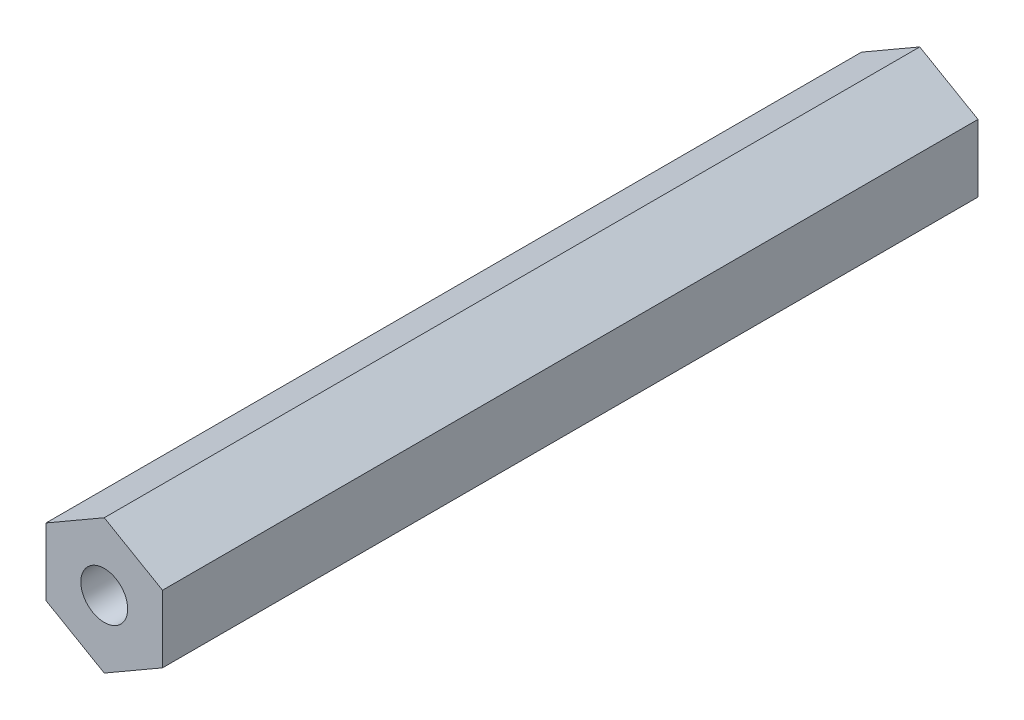
ISO-10303-21;
HEADER;
FILE_DESCRIPTION(('STEP AP214'),'2;1');
FILE_NAME('part.step','',(''),(''),'','','');
FILE_SCHEMA(('AUTOMOTIVE_DESIGN { 1 0 10303 214 1 1 1 1 }'));
ENDSEC;
DATA;
#1=APPLICATION_CONTEXT('core data for automotive mechanical design processes');
#2=APPLICATION_PROTOCOL_DEFINITION('international standard','automotive_design',2000,#1);
#3=PRODUCT_CONTEXT('',#1,'mechanical');
#4=PRODUCT('Part','Part','',(#3));
#5=PRODUCT_RELATED_PRODUCT_CATEGORY('part','',(#4));
#6=PRODUCT_DEFINITION_FORMATION('','',#4);
#7=PRODUCT_DEFINITION_CONTEXT('part definition',#1,'design');
#8=PRODUCT_DEFINITION('design','',#6,#7);
#9=PRODUCT_DEFINITION_SHAPE('','',#8);
#10=(LENGTH_UNIT() NAMED_UNIT(*) SI_UNIT(.MILLI.,.METRE.));
#11=(NAMED_UNIT(*) PLANE_ANGLE_UNIT() SI_UNIT($,.RADIAN.));
#12=(NAMED_UNIT(*) SI_UNIT($,.STERADIAN.) SOLID_ANGLE_UNIT());
#13=UNCERTAINTY_MEASURE_WITH_UNIT(LENGTH_MEASURE(1.E-05),#10,'distance_accuracy_value','');
#14=(GEOMETRIC_REPRESENTATION_CONTEXT(3) GLOBAL_UNCERTAINTY_ASSIGNED_CONTEXT((#13)) GLOBAL_UNIT_ASSIGNED_CONTEXT((#10,
#11,#12)) REPRESENTATION_CONTEXT('',''));
#15=CARTESIAN_POINT('',(0.,0.,0.));
#16=DIRECTION('',(0.,0.,1.));
#17=DIRECTION('',(1.,0.,0.));
#18=AXIS2_PLACEMENT_3D('',#15,#16,#17);
#19=CARTESIAN_POINT('',(6.35,-3.66617420935412,88.9));
#20=DIRECTION('',(-1.,0.,0.));
#21=DIRECTION('',(0.,-1.,0.));
#22=AXIS2_PLACEMENT_3D('',#19,#20,#21);
#23=PLANE('',#22);
#24=DIRECTION('',(0.,1.,0.));
#25=VECTOR('',#24,1.);
#26=CARTESIAN_POINT('',(6.35,-3.66617420935412,0.));
#27=LINE('',#26,#25);
#28=CARTESIAN_POINT('',(6.35,-3.66617420935412,0.));
#29=VERTEX_POINT('',#28);
#30=CARTESIAN_POINT('',(6.35,3.66617420935413,0.));
#31=VERTEX_POINT('',#30);
#32=EDGE_CURVE('E139',#29,#31,#27,.T.);
#33=ORIENTED_EDGE('',*,*,#32,.T.);
#34=DIRECTION('',(0.,0.,-1.));
#35=VECTOR('',#34,1.);
#36=CARTESIAN_POINT('',(6.35,3.66617420935413,88.9));
#37=LINE('',#36,#35);
#38=CARTESIAN_POINT('',(6.35,3.66617420935413,88.9));
#39=VERTEX_POINT('',#38);
#40=EDGE_CURVE('E11',#39,#31,#37,.T.);
#41=ORIENTED_EDGE('',*,*,#40,.F.);
#42=DIRECTION('',(0.,1.,0.));
#43=VECTOR('',#42,1.);
#44=CARTESIAN_POINT('',(6.35,-3.66617420935412,88.9));
#45=LINE('',#44,#43);
#46=CARTESIAN_POINT('',(6.35,-3.66617420935412,88.9));
#47=VERTEX_POINT('',#46);
#48=EDGE_CURVE('E156',#47,#39,#45,.T.);
#49=ORIENTED_EDGE('',*,*,#48,.F.);
#50=DIRECTION('',(0.,0.,-1.));
#51=VECTOR('',#50,1.);
#52=CARTESIAN_POINT('',(6.35,-3.66617420935412,88.9));
#53=LINE('',#52,#51);
#54=EDGE_CURVE('E135',#47,#29,#53,.T.);
#55=ORIENTED_EDGE('',*,*,#54,.T.);
#56=EDGE_LOOP('',(#33,#41,#49,#55));
#57=FACE_BOUND('',#56,.T.);
#58=ADVANCED_FACE('F46',(#57),#23,.F.);
#59=CARTESIAN_POINT('',(6.35,3.66617420935413,88.9));
#60=DIRECTION('',(-0.5,-0.866025403784439,0.));
#61=DIRECTION('',(0.866025403784439,-0.5,0.));
#62=AXIS2_PLACEMENT_3D('',#59,#60,#61);
#63=PLANE('',#62);
#64=DIRECTION('',(-0.866025403784439,0.5,0.));
#65=VECTOR('',#64,1.);
#66=CARTESIAN_POINT('',(6.35,3.66617420935413,0.));
#67=LINE('',#66,#65);
#68=CARTESIAN_POINT('',(0.,7.33234841870824,0.));
#69=VERTEX_POINT('',#68);
#70=EDGE_CURVE('E143',#31,#69,#67,.T.);
#71=ORIENTED_EDGE('',*,*,#70,.T.);
#72=DIRECTION('',(0.,0.,-1.));
#73=VECTOR('',#72,1.);
#74=CARTESIAN_POINT('',(0.,7.33234841870824,88.9));
#75=LINE('',#74,#73);
#76=CARTESIAN_POINT('',(0.,7.33234841870824,88.9));
#77=VERTEX_POINT('',#76);
#78=EDGE_CURVE('E55',#77,#69,#75,.T.);
#79=ORIENTED_EDGE('',*,*,#78,.F.);
#80=DIRECTION('',(-0.866025403784439,0.5,0.));
#81=VECTOR('',#80,1.);
#82=CARTESIAN_POINT('',(6.35,3.66617420935413,88.9));
#83=LINE('',#82,#81);
#84=EDGE_CURVE('E101',#39,#77,#83,.T.);
#85=ORIENTED_EDGE('',*,*,#84,.F.);
#86=ORIENTED_EDGE('',*,*,#40,.T.);
#87=EDGE_LOOP('',(#71,#79,#85,#86));
#88=FACE_BOUND('',#87,.T.);
#89=ADVANCED_FACE('F186',(#88),#63,.F.);
#90=CARTESIAN_POINT('',(0.,7.33234841870824,88.9));
#91=DIRECTION('',(0.5,-0.866025403784439,0.));
#92=DIRECTION('',(0.866025403784439,0.5,0.));
#93=AXIS2_PLACEMENT_3D('',#90,#91,#92);
#94=PLANE('',#93);
#95=DIRECTION('',(-0.866025403784439,-0.5,0.));
#96=VECTOR('',#95,1.);
#97=CARTESIAN_POINT('',(0.,7.33234841870824,0.));
#98=LINE('',#97,#96);
#99=CARTESIAN_POINT('',(-6.35,3.66617420935412,0.));
#100=VERTEX_POINT('',#99);
#101=EDGE_CURVE('E147',#69,#100,#98,.T.);
#102=ORIENTED_EDGE('',*,*,#101,.T.);
#103=DIRECTION('',(0.,0.,-1.));
#104=VECTOR('',#103,1.);
#105=CARTESIAN_POINT('',(-6.35,3.66617420935412,88.9));
#106=LINE('',#105,#104);
#107=CARTESIAN_POINT('',(-6.35,3.66617420935412,88.9));
#108=VERTEX_POINT('',#107);
#109=EDGE_CURVE('E127',#108,#100,#106,.T.);
#110=ORIENTED_EDGE('',*,*,#109,.F.);
#111=DIRECTION('',(-0.866025403784439,-0.5,0.));
#112=VECTOR('',#111,1.);
#113=CARTESIAN_POINT('',(0.,7.33234841870824,88.9));
#114=LINE('',#113,#112);
#115=EDGE_CURVE('E116',#77,#108,#114,.T.);
#116=ORIENTED_EDGE('',*,*,#115,.F.);
#117=ORIENTED_EDGE('',*,*,#78,.T.);
#118=EDGE_LOOP('',(#102,#110,#116,#117));
#119=FACE_BOUND('',#118,.T.);
#120=ADVANCED_FACE('F167',(#119),#94,.F.);
#121=CARTESIAN_POINT('',(-6.35,3.66617420935412,88.9));
#122=DIRECTION('',(1.,0.,0.));
#123=DIRECTION('',(0.,1.,0.));
#124=AXIS2_PLACEMENT_3D('',#121,#122,#123);
#125=PLANE('',#124);
#126=DIRECTION('',(0.,-1.,0.));
#127=VECTOR('',#126,1.);
#128=CARTESIAN_POINT('',(-6.35,3.66617420935412,0.));
#129=LINE('',#128,#127);
#130=CARTESIAN_POINT('',(-6.35,-3.66617420935412,0.));
#131=VERTEX_POINT('',#130);
#132=EDGE_CURVE('E125',#100,#131,#129,.T.);
#133=ORIENTED_EDGE('',*,*,#132,.T.);
#134=DIRECTION('',(0.,0.,-1.));
#135=VECTOR('',#134,1.);
#136=CARTESIAN_POINT('',(-6.35,-3.66617420935412,88.9));
#137=LINE('',#136,#135);
#138=CARTESIAN_POINT('',(-6.35,-3.66617420935412,88.9));
#139=VERTEX_POINT('',#138);
#140=EDGE_CURVE('E122',#139,#131,#137,.T.);
#141=ORIENTED_EDGE('',*,*,#140,.F.);
#142=DIRECTION('',(0.,-1.,0.));
#143=VECTOR('',#142,1.);
#144=CARTESIAN_POINT('',(-6.35,3.66617420935412,88.9));
#145=LINE('',#144,#143);
#146=EDGE_CURVE('E110',#108,#139,#145,.T.);
#147=ORIENTED_EDGE('',*,*,#146,.F.);
#148=ORIENTED_EDGE('',*,*,#109,.T.);
#149=EDGE_LOOP('',(#133,#141,#147,#148));
#150=FACE_BOUND('',#149,.T.);
#151=ADVANCED_FACE('F123',(#150),#125,.F.);
#152=CARTESIAN_POINT('',(-6.35,-3.66617420935412,88.9));
#153=DIRECTION('',(0.5,0.866025403784439,0.));
#154=DIRECTION('',(-0.866025403784439,0.5,0.));
#155=AXIS2_PLACEMENT_3D('',#152,#153,#154);
#156=PLANE('',#155);
#157=DIRECTION('',(0.866025403784439,-0.5,0.));
#158=VECTOR('',#157,1.);
#159=CARTESIAN_POINT('',(-6.35,-3.66617420935412,0.));
#160=LINE('',#159,#158);
#161=CARTESIAN_POINT('',(0.,-7.33234841870825,0.));
#162=VERTEX_POINT('',#161);
#163=EDGE_CURVE('E87',#131,#162,#160,.T.);
#164=ORIENTED_EDGE('',*,*,#163,.T.);
#165=DIRECTION('',(0.,0.,-1.));
#166=VECTOR('',#165,1.);
#167=CARTESIAN_POINT('',(0.,-7.33234841870825,88.9));
#168=LINE('',#167,#166);
#169=CARTESIAN_POINT('',(0.,-7.33234841870825,88.9));
#170=VERTEX_POINT('',#169);
#171=EDGE_CURVE('E128',#170,#162,#168,.T.);
#172=ORIENTED_EDGE('',*,*,#171,.F.);
#173=DIRECTION('',(0.866025403784439,-0.5,0.));
#174=VECTOR('',#173,1.);
#175=CARTESIAN_POINT('',(-6.35,-3.66617420935412,88.9));
#176=LINE('',#175,#174);
#177=EDGE_CURVE('E114',#139,#170,#176,.T.);
#178=ORIENTED_EDGE('',*,*,#177,.F.);
#179=ORIENTED_EDGE('',*,*,#140,.T.);
#180=EDGE_LOOP('',(#164,#172,#178,#179));
#181=FACE_BOUND('',#180,.T.);
#182=ADVANCED_FACE('F130',(#181),#156,.F.);
#183=CARTESIAN_POINT('',(0.,-7.33234841870825,88.9));
#184=DIRECTION('',(-0.5,0.866025403784438,0.));
#185=DIRECTION('',(-0.866025403784439,-0.5,0.));
#186=AXIS2_PLACEMENT_3D('',#183,#184,#185);
#187=PLANE('',#186);
#188=DIRECTION('',(0.866025403784438,0.5,0.));
#189=VECTOR('',#188,1.);
#190=CARTESIAN_POINT('',(0.,-7.33234841870825,0.));
#191=LINE('',#190,#189);
#192=EDGE_CURVE('E93',#162,#29,#191,.T.);
#193=ORIENTED_EDGE('',*,*,#192,.T.);
#194=ORIENTED_EDGE('',*,*,#54,.F.);
#195=DIRECTION('',(0.866025403784438,0.5,0.));
#196=VECTOR('',#195,1.);
#197=CARTESIAN_POINT('',(0.,-7.33234841870825,88.9));
#198=LINE('',#197,#196);
#199=EDGE_CURVE('E63',#170,#47,#198,.T.);
#200=ORIENTED_EDGE('',*,*,#199,.F.);
#201=ORIENTED_EDGE('',*,*,#171,.T.);
#202=EDGE_LOOP('',(#193,#194,#200,#201));
#203=FACE_BOUND('',#202,.T.);
#204=ADVANCED_FACE('F174',(#203),#187,.F.);
#205=CARTESIAN_POINT('',(0.,0.,88.9));
#206=DIRECTION('',(0.,0.,1.));
#207=DIRECTION('',(1.,0.,0.));
#208=AXIS2_PLACEMENT_3D('',#205,#206,#207);
#209=PLANE('',#208);
#210=CARTESIAN_POINT('',(0.,0.,88.9));
#211=DIRECTION('',(0.,0.,1.));
#212=DIRECTION('',(1.,0.,0.));
#213=AXIS2_PLACEMENT_3D('',#210,#211,#212);
#214=CIRCLE('',#213,2.5527);
#215=CARTESIAN_POINT('',(2.5527,0.,88.9));
#216=VERTEX_POINT('',#215);
#217=EDGE_CURVE('E341',#216,#216,#214,.T.);
#218=ORIENTED_EDGE('',*,*,#217,.F.);
#219=EDGE_LOOP('',(#218));
#220=FACE_BOUND('',#219,.T.);
#221=ORIENTED_EDGE('',*,*,#48,.T.);
#222=ORIENTED_EDGE('',*,*,#84,.T.);
#223=ORIENTED_EDGE('',*,*,#115,.T.);
#224=ORIENTED_EDGE('',*,*,#146,.T.);
#225=ORIENTED_EDGE('',*,*,#177,.T.);
#226=ORIENTED_EDGE('',*,*,#199,.T.);
#227=EDGE_LOOP('',(#221,#222,#223,#224,#225,#226));
#228=FACE_BOUND('',#227,.T.);
#229=ADVANCED_FACE('F112',(#220,#228),#209,.T.);
#230=CARTESIAN_POINT('',(0.,0.,0.));
#231=DIRECTION('',(0.,0.,1.));
#232=DIRECTION('',(1.,0.,0.));
#233=AXIS2_PLACEMENT_3D('',#230,#231,#232);
#234=PLANE('',#233);
#235=CARTESIAN_POINT('',(0.,0.,0.));
#236=DIRECTION('',(0.,0.,-1.));
#237=DIRECTION('',(-1.,0.,0.));
#238=AXIS2_PLACEMENT_3D('',#235,#236,#237);
#239=CIRCLE('',#238,2.5527);
#240=CARTESIAN_POINT('',(-2.5527,0.,0.));
#241=VERTEX_POINT('',#240);
#242=EDGE_CURVE('E336',#241,#241,#239,.T.);
#243=ORIENTED_EDGE('',*,*,#242,.F.);
#244=EDGE_LOOP('',(#243));
#245=FACE_BOUND('',#244,.T.);
#246=ORIENTED_EDGE('',*,*,#32,.F.);
#247=ORIENTED_EDGE('',*,*,#192,.F.);
#248=ORIENTED_EDGE('',*,*,#163,.F.);
#249=ORIENTED_EDGE('',*,*,#132,.F.);
#250=ORIENTED_EDGE('',*,*,#101,.F.);
#251=ORIENTED_EDGE('',*,*,#70,.F.);
#252=EDGE_LOOP('',(#246,#247,#248,#249,#250,#251));
#253=FACE_BOUND('',#252,.T.);
#254=ADVANCED_FACE('F170',(#245,#253),#234,.F.);
#255=CARTESIAN_POINT('',(0.,0.,72.39));
#256=DIRECTION('',(0.,0.,1.));
#257=DIRECTION('',(1.,0.,0.));
#258=AXIS2_PLACEMENT_3D('',#255,#256,#257);
#259=CONICAL_SURFACE('',#258,2.5527,1.02974425867665);
#260=CARTESIAN_POINT('',(0.,0.,70.8561830978083));
#261=VERTEX_POINT('',#260);
#262=VERTEX_LOOP('',#261);
#263=FACE_BOUND('',#262,.T.);
#264=CARTESIAN_POINT('',(0.,0.,72.39));
#265=DIRECTION('',(0.,0.,1.));
#266=DIRECTION('',(1.,0.,0.));
#267=AXIS2_PLACEMENT_3D('',#264,#265,#266);
#268=CIRCLE('',#267,2.5527);
#269=CARTESIAN_POINT('',(2.5527,0.,72.39));
#270=VERTEX_POINT('',#269);
#271=EDGE_CURVE('E144',#270,#270,#268,.T.);
#272=ORIENTED_EDGE('',*,*,#271,.T.);
#273=EDGE_LOOP('',(#272));
#274=FACE_BOUND('',#273,.T.);
#275=ADVANCED_FACE('F226',(#263,#274),#259,.F.);
#276=CARTESIAN_POINT('',(0.,0.,88.9));
#277=DIRECTION('',(0.,0.,1.));
#278=DIRECTION('',(1.,0.,0.));
#279=AXIS2_PLACEMENT_3D('',#276,#277,#278);
#280=CYLINDRICAL_SURFACE('',#279,2.5527);
#281=ORIENTED_EDGE('',*,*,#271,.F.);
#282=EDGE_LOOP('',(#281));
#283=FACE_BOUND('',#282,.T.);
#284=ORIENTED_EDGE('',*,*,#217,.T.);
#285=EDGE_LOOP('',(#284));
#286=FACE_BOUND('',#285,.T.);
#287=ADVANCED_FACE('F235',(#283,#286),#280,.F.);
#288=CARTESIAN_POINT('',(0.,0.,16.51));
#289=DIRECTION('',(0.,0.,-1.));
#290=DIRECTION('',(-1.,0.,0.));
#291=AXIS2_PLACEMENT_3D('',#288,#289,#290);
#292=CONICAL_SURFACE('',#291,2.5527,1.02974425867665);
#293=CARTESIAN_POINT('',(0.,0.,18.0438169021917));
#294=VERTEX_POINT('',#293);
#295=VERTEX_LOOP('',#294);
#296=FACE_BOUND('',#295,.T.);
#297=CARTESIAN_POINT('',(0.,0.,16.51));
#298=DIRECTION('',(0.,0.,-1.));
#299=DIRECTION('',(-1.,0.,0.));
#300=AXIS2_PLACEMENT_3D('',#297,#298,#299);
#301=CIRCLE('',#300,2.5527);
#302=CARTESIAN_POINT('',(-2.5527,0.,16.51));
#303=VERTEX_POINT('',#302);
#304=EDGE_CURVE('E333',#303,#303,#301,.T.);
#305=ORIENTED_EDGE('',*,*,#304,.T.);
#306=EDGE_LOOP('',(#305));
#307=FACE_BOUND('',#306,.T.);
#308=ADVANCED_FACE('F246',(#296,#307),#292,.F.);
#309=CARTESIAN_POINT('',(0.,0.,0.));
#310=DIRECTION('',(0.,0.,-1.));
#311=DIRECTION('',(-1.,0.,0.));
#312=AXIS2_PLACEMENT_3D('',#309,#310,#311);
#313=CYLINDRICAL_SURFACE('',#312,2.5527);
#314=ORIENTED_EDGE('',*,*,#304,.F.);
#315=EDGE_LOOP('',(#314));
#316=FACE_BOUND('',#315,.T.);
#317=ORIENTED_EDGE('',*,*,#242,.T.);
#318=EDGE_LOOP('',(#317));
#319=FACE_BOUND('',#318,.T.);
#320=ADVANCED_FACE('F257',(#316,#319),#313,.F.);
#321=CLOSED_SHELL('',(#58,#89,#120,#151,#182,#204,#229,#254,#275,#287,#308,#320));
#322=MANIFOLD_SOLID_BREP('B2',#321);
#323=ADVANCED_BREP_SHAPE_REPRESENTATION('',(#18,#322),#14);
#324=SHAPE_DEFINITION_REPRESENTATION(#9,#323);
ENDSEC;
END-ISO-10303-21;
